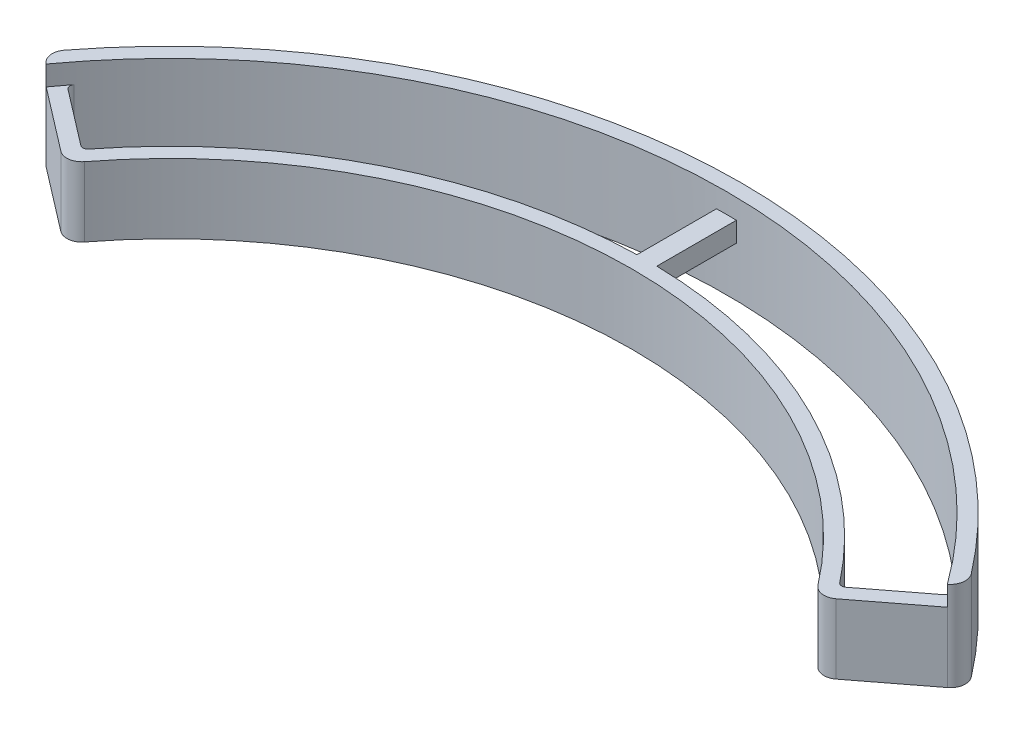
ISO-10303-21;
HEADER;
FILE_DESCRIPTION(('STEP AP214'),'2;1');
FILE_NAME('part.step','',(''),(''),'','','');
FILE_SCHEMA(('AUTOMOTIVE_DESIGN { 1 0 10303 214 1 1 1 1 }'));
ENDSEC;
DATA;
#1=APPLICATION_CONTEXT('core data for automotive mechanical design processes');
#2=APPLICATION_PROTOCOL_DEFINITION('international standard','automotive_design',2000,#1);
#3=PRODUCT_CONTEXT('',#1,'mechanical');
#4=PRODUCT('Part','Part','',(#3));
#5=PRODUCT_RELATED_PRODUCT_CATEGORY('part','',(#4));
#6=PRODUCT_DEFINITION_FORMATION('','',#4);
#7=PRODUCT_DEFINITION_CONTEXT('part definition',#1,'design');
#8=PRODUCT_DEFINITION('design','',#6,#7);
#9=PRODUCT_DEFINITION_SHAPE('','',#8);
#10=(LENGTH_UNIT() NAMED_UNIT(*) SI_UNIT(.MILLI.,.METRE.));
#11=(NAMED_UNIT(*) PLANE_ANGLE_UNIT() SI_UNIT($,.RADIAN.));
#12=(NAMED_UNIT(*) SI_UNIT($,.STERADIAN.) SOLID_ANGLE_UNIT());
#13=UNCERTAINTY_MEASURE_WITH_UNIT(LENGTH_MEASURE(1.E-05),#10,'distance_accuracy_value','');
#14=(GEOMETRIC_REPRESENTATION_CONTEXT(3) GLOBAL_UNCERTAINTY_ASSIGNED_CONTEXT((#13)) GLOBAL_UNIT_ASSIGNED_CONTEXT((#10,
#11,#12)) REPRESENTATION_CONTEXT('',''));
#15=CARTESIAN_POINT('',(0.,0.,0.));
#16=DIRECTION('',(0.,0.,1.));
#17=DIRECTION('',(1.,0.,0.));
#18=AXIS2_PLACEMENT_3D('',#15,#16,#17);
#19=CARTESIAN_POINT('',(0.,0.,0.));
#20=DIRECTION('',(0.,-1.,0.));
#21=DIRECTION('',(0.,0.,-1.));
#22=AXIS2_PLACEMENT_3D('',#19,#20,#21);
#23=PLANE('',#22);
#24=CARTESIAN_POINT('',(0.,0.,0.));
#25=DIRECTION('',(0.,-1.,0.));
#26=DIRECTION('',(0.,0.,-1.));
#27=AXIS2_PLACEMENT_3D('',#24,#25,#26);
#28=CIRCLE('',#27,46.5);
#29=CARTESIAN_POINT('',(-36.8909303235425,0.,-28.3074064489054));
#30=VERTEX_POINT('',#29);
#31=CARTESIAN_POINT('',(36.8909303235425,0.,-28.3074064489054));
#32=VERTEX_POINT('',#31);
#33=EDGE_CURVE('E305',#30,#32,#28,.T.);
#34=ORIENTED_EDGE('',*,*,#33,.T.);
#35=CARTESIAN_POINT('',(38.0809603339793,0.,-29.2205485924185));
#36=DIRECTION('',(0.,-1.,0.));
#37=DIRECTION('',(0.,0.,-1.));
#38=AXIS2_PLACEMENT_3D('',#35,#36,#37);
#39=CIRCLE('',#38,1.5);
#40=CARTESIAN_POINT('',(38.9941024774924,0.,-28.0305185819817));
#41=VERTEX_POINT('',#40);
#42=EDGE_CURVE('E54',#32,#41,#39,.F.);
#43=ORIENTED_EDGE('',*,*,#42,.T.);
#44=DIRECTION('',(0.793353340291236,0.,-0.608761429008719));
#45=VECTOR('',#44,1.);
#46=CARTESIAN_POINT('',(37.7848734387849,0.,-27.1026445059335));
#47=LINE('',#46,#45);
#48=CARTESIAN_POINT('',(45.3249884381113,0.,-32.8883782373816));
#49=VERTEX_POINT('',#48);
#50=EDGE_CURVE('E302',#41,#49,#47,.T.);
#51=ORIENTED_EDGE('',*,*,#50,.T.);
#52=CARTESIAN_POINT('',(0.,0.,0.));
#53=DIRECTION('',(0.,-1.,0.));
#54=DIRECTION('',(0.,0.,-1.));
#55=AXIS2_PLACEMENT_3D('',#52,#53,#54);
#56=CIRCLE('',#55,56.);
#57=CARTESIAN_POINT('',(44.1188612071901,0.,-34.4895068938467));
#58=VERTEX_POINT('',#57);
#59=EDGE_CURVE('E223',#58,#49,#56,.T.);
#60=ORIENTED_EDGE('',*,*,#59,.F.);
#61=CARTESIAN_POINT('',(43.7249428035545,0.,-34.1815648680088));
#62=DIRECTION('',(0.,-1.,0.));
#63=DIRECTION('',(0.,0.,-1.));
#64=AXIS2_PLACEMENT_3D('',#61,#62,#63);
#65=CIRCLE('',#64,0.5);
#66=CARTESIAN_POINT('',(44.0293235180588,0.,-33.7848881978631));
#67=VERTEX_POINT('',#66);
#68=EDGE_CURVE('E297',#58,#67,#65,.T.);
#69=ORIENTED_EDGE('',*,*,#68,.T.);
#70=DIRECTION('',(0.793353340291236,0.,-0.608761429008719));
#71=VECTOR('',#70,1.);
#72=CARTESIAN_POINT('',(38.0809603339793,0.,-29.2205485924185));
#73=LINE('',#72,#71);
#74=CARTESIAN_POINT('',(38.4755922246893,0.,-29.5233602924774));
#75=VERTEX_POINT('',#74);
#76=EDGE_CURVE('E275',#75,#67,#73,.T.);
#77=ORIENTED_EDGE('',*,*,#76,.F.);
#78=CARTESIAN_POINT('',(38.1712115101849,0.,-29.920036962623));
#79=DIRECTION('',(0.,-1.,0.));
#80=DIRECTION('',(0.,0.,-1.));
#81=AXIS2_PLACEMENT_3D('',#78,#79,#80);
#82=CIRCLE('',#81,0.5);
#83=CARTESIAN_POINT('',(37.77769386575,0.,-29.6115829733176));
#84=VERTEX_POINT('',#83);
#85=EDGE_CURVE('E293',#75,#84,#82,.T.);
#86=ORIENTED_EDGE('',*,*,#85,.T.);
#87=CARTESIAN_POINT('',(0.,0.,0.));
#88=DIRECTION('',(0.,-1.,0.));
#89=DIRECTION('',(0.,0.,-1.));
#90=AXIS2_PLACEMENT_3D('',#87,#88,#89);
#91=CIRCLE('',#90,48.);
#92=CARTESIAN_POINT('',(0.999999999999995,0.,-47.9895822028073));
#93=VERTEX_POINT('',#92);
#94=EDGE_CURVE('E261',#93,#84,#91,.T.);
#95=ORIENTED_EDGE('',*,*,#94,.F.);
#96=DIRECTION('',(0.,0.,-1.));
#97=VECTOR('',#96,1.);
#98=CARTESIAN_POINT('',(0.999999999999993,0.,-56.7594807549207));
#99=LINE('',#98,#97);
#100=CARTESIAN_POINT('',(0.999999999999993,0.,-55.9910707166777));
#101=VERTEX_POINT('',#100);
#102=EDGE_CURVE('E202',#93,#101,#99,.T.);
#103=ORIENTED_EDGE('',*,*,#102,.T.);
#104=CARTESIAN_POINT('',(-1.00000000000001,0.,-55.9910707166777));
#105=VERTEX_POINT('',#104);
#106=EDGE_CURVE('E229',#105,#101,#56,.T.);
#107=ORIENTED_EDGE('',*,*,#106,.F.);
#108=DIRECTION('',(0.,0.,1.));
#109=VECTOR('',#108,1.);
#110=CARTESIAN_POINT('',(-1.00000000000001,0.,-56.7594807549207));
#111=LINE('',#110,#109);
#112=CARTESIAN_POINT('',(-1.00000000000001,0.,-47.9895822028073));
#113=VERTEX_POINT('',#112);
#114=EDGE_CURVE('E243',#105,#113,#111,.T.);
#115=ORIENTED_EDGE('',*,*,#114,.T.);
#116=CARTESIAN_POINT('',(-37.77769386575,0.,-29.6115829733176));
#117=VERTEX_POINT('',#116);
#118=EDGE_CURVE('E279',#117,#113,#91,.T.);
#119=ORIENTED_EDGE('',*,*,#118,.F.);
#120=CARTESIAN_POINT('',(-38.1712115101849,0.,-29.920036962623));
#121=DIRECTION('',(0.,-1.,0.));
#122=DIRECTION('',(0.,0.,-1.));
#123=AXIS2_PLACEMENT_3D('',#120,#121,#122);
#124=CIRCLE('',#123,0.5);
#125=CARTESIAN_POINT('',(-38.4755922246893,0.,-29.5233602924774));
#126=VERTEX_POINT('',#125);
#127=EDGE_CURVE('E284',#117,#126,#124,.T.);
#128=ORIENTED_EDGE('',*,*,#127,.T.);
#129=DIRECTION('',(0.793353340291236,0.,0.608761429008719));
#130=VECTOR('',#129,1.);
#131=CARTESIAN_POINT('',(-38.0809603339793,0.,-29.2205485924185));
#132=LINE('',#131,#130);
#133=CARTESIAN_POINT('',(-44.0293235180588,0.,-33.7848881978631));
#134=VERTEX_POINT('',#133);
#135=EDGE_CURVE('E237',#134,#126,#132,.T.);
#136=ORIENTED_EDGE('',*,*,#135,.F.);
#137=CARTESIAN_POINT('',(-43.7249428035545,0.,-34.1815648680088));
#138=DIRECTION('',(0.,-1.,0.));
#139=DIRECTION('',(0.,0.,-1.));
#140=AXIS2_PLACEMENT_3D('',#137,#138,#139);
#141=CIRCLE('',#140,0.5);
#142=CARTESIAN_POINT('',(-44.1188612071901,0.,-34.4895068938467));
#143=VERTEX_POINT('',#142);
#144=EDGE_CURVE('E288',#134,#143,#141,.T.);
#145=ORIENTED_EDGE('',*,*,#144,.T.);
#146=CARTESIAN_POINT('',(-45.3249884381113,0.,-32.8883782373816));
#147=VERTEX_POINT('',#146);
#148=EDGE_CURVE('E215',#147,#143,#56,.T.);
#149=ORIENTED_EDGE('',*,*,#148,.F.);
#150=DIRECTION('',(0.793353340291237,0.,0.608761429008719));
#151=VECTOR('',#150,1.);
#152=CARTESIAN_POINT('',(-37.7848734387849,0.,-27.1026445059335));
#153=LINE('',#152,#151);
#154=CARTESIAN_POINT('',(-38.9941024774924,0.,-28.0305185819817));
#155=VERTEX_POINT('',#154);
#156=EDGE_CURVE('E200',#147,#155,#153,.T.);
#157=ORIENTED_EDGE('',*,*,#156,.T.);
#158=CARTESIAN_POINT('',(-38.0809603339794,0.,-29.2205485924185));
#159=DIRECTION('',(0.,-1.,0.));
#160=DIRECTION('',(0.,0.,-1.));
#161=AXIS2_PLACEMENT_3D('',#158,#159,#160);
#162=CIRCLE('',#161,1.5);
#163=EDGE_CURVE('E47',#155,#30,#162,.F.);
#164=ORIENTED_EDGE('',*,*,#163,.T.);
#165=EDGE_LOOP('',(#34,#43,#51,#60,#69,#77,#86,#95,#103,#107,#115,#119,#128,#136,#145,#149,#157,#164));
#166=FACE_BOUND('',#165,.T.);
#167=ADVANCED_FACE('F32',(#166),#23,.F.);
#168=CARTESIAN_POINT('',(0.,-7.,0.));
#169=DIRECTION('',(0.,1.,0.));
#170=DIRECTION('',(0.,0.,1.));
#171=AXIS2_PLACEMENT_3D('',#168,#169,#170);
#172=CYLINDRICAL_SURFACE('',#171,46.5);
#173=CARTESIAN_POINT('',(0.,-7.,0.));
#174=DIRECTION('',(0.,-1.,0.));
#175=DIRECTION('',(0.,0.,-1.));
#176=AXIS2_PLACEMENT_3D('',#173,#174,#175);
#177=CIRCLE('',#176,46.5);
#178=CARTESIAN_POINT('',(-36.8909303235425,-7.,-28.3074064489054));
#179=VERTEX_POINT('',#178);
#180=CARTESIAN_POINT('',(36.8909303235425,-7.,-28.3074064489054));
#181=VERTEX_POINT('',#180);
#182=EDGE_CURVE('E316',#179,#181,#177,.T.);
#183=ORIENTED_EDGE('',*,*,#182,.T.);
#184=DIRECTION('',(0.,1.,0.));
#185=VECTOR('',#184,1.);
#186=CARTESIAN_POINT('',(36.8909303235425,-7.,-28.3074064489054));
#187=LINE('',#186,#185);
#188=EDGE_CURVE('E451',#181,#32,#187,.T.);
#189=ORIENTED_EDGE('',*,*,#188,.T.);
#190=ORIENTED_EDGE('',*,*,#33,.F.);
#191=DIRECTION('',(0.,1.,0.));
#192=VECTOR('',#191,1.);
#193=CARTESIAN_POINT('',(-36.8909303235425,-7.,-28.3074064489054));
#194=LINE('',#193,#192);
#195=EDGE_CURVE('E437',#30,#179,#194,.F.);
#196=ORIENTED_EDGE('',*,*,#195,.T.);
#197=EDGE_LOOP('',(#183,#189,#190,#196));
#198=FACE_BOUND('',#197,.T.);
#199=ADVANCED_FACE('F385',(#198),#172,.F.);
#200=CARTESIAN_POINT('',(-37.7848734387849,-7.,-27.1026445059335));
#201=DIRECTION('',(-0.608761429008719,0.,0.793353340291237));
#202=DIRECTION('',(0.793353340291237,0.,0.608761429008719));
#203=AXIS2_PLACEMENT_3D('',#200,#201,#202);
#204=PLANE('',#203);
#205=DIRECTION('',(0.793353340291237,0.,0.608761429008719));
#206=VECTOR('',#205,1.);
#207=CARTESIAN_POINT('',(-37.7848734387849,-7.,-27.1026445059335));
#208=LINE('',#207,#206);
#209=CARTESIAN_POINT('',(-45.3409291998223,-7.,-32.9006100140514));
#210=VERTEX_POINT('',#209);
#211=CARTESIAN_POINT('',(-38.9941024774924,-7.,-28.0305185819817));
#212=VERTEX_POINT('',#211);
#213=EDGE_CURVE('E323',#210,#212,#208,.T.);
#214=ORIENTED_EDGE('',*,*,#213,.T.);
#215=DIRECTION('',(0.,1.,0.));
#216=VECTOR('',#215,1.);
#217=CARTESIAN_POINT('',(-38.9941024774924,-7.,-28.0305185819817));
#218=LINE('',#217,#216);
#219=EDGE_CURVE('E11',#212,#155,#218,.T.);
#220=ORIENTED_EDGE('',*,*,#219,.T.);
#221=ORIENTED_EDGE('',*,*,#156,.F.);
#222=DIRECTION('',(0.,-1.,0.));
#223=VECTOR('',#222,1.);
#224=CARTESIAN_POINT('',(-45.3249884381113,2.,-32.8883782373816));
#225=LINE('',#224,#223);
#226=CARTESIAN_POINT('',(-45.3249884381113,2.,-32.8883782373816));
#227=VERTEX_POINT('',#226);
#228=EDGE_CURVE('E196',#227,#147,#225,.T.);
#229=ORIENTED_EDGE('',*,*,#228,.F.);
#230=DIRECTION('',(0.793353340291236,0.,0.60876142900872));
#231=VECTOR('',#230,1.);
#232=CARTESIAN_POINT('',(-45.3249884381113,2.,-32.8883782373816));
#233=LINE('',#232,#231);
#234=CARTESIAN_POINT('',(-45.3409291998223,2.,-32.9006100140514));
#235=VERTEX_POINT('',#234);
#236=EDGE_CURVE('E181',#235,#227,#233,.T.);
#237=ORIENTED_EDGE('',*,*,#236,.F.);
#238=DIRECTION('',(0.,1.,0.));
#239=VECTOR('',#238,1.);
#240=CARTESIAN_POINT('',(-45.3409291998223,-7.,-32.9006100140514));
#241=LINE('',#240,#239);
#242=EDGE_CURVE('E40',#235,#210,#241,.F.);
#243=ORIENTED_EDGE('',*,*,#242,.T.);
#244=EDGE_LOOP('',(#214,#220,#221,#229,#237,#243));
#245=FACE_BOUND('',#244,.T.);
#246=ADVANCED_FACE('F198',(#245),#204,.T.);
#247=CARTESIAN_POINT('',(0.,-7.,0.));
#248=DIRECTION('',(0.,1.,0.));
#249=DIRECTION('',(0.,0.,1.));
#250=AXIS2_PLACEMENT_3D('',#247,#248,#249);
#251=CYLINDRICAL_SURFACE('',#250,57.5);
#252=CARTESIAN_POINT('',(0.,2.,0.));
#253=DIRECTION('',(0.,1.,0.));
#254=DIRECTION('',(0.,0.,-1.));
#255=AXIS2_PLACEMENT_3D('',#252,#253,#254);
#256=CIRCLE('',#255,57.5);
#257=CARTESIAN_POINT('',(45.6178170667461,2.,-35.0037821680013));
#258=VERTEX_POINT('',#257);
#259=CARTESIAN_POINT('',(-45.6178170667461,2.,-35.0037821680014));
#260=VERTEX_POINT('',#259);
#261=EDGE_CURVE('E192',#258,#260,#256,.T.);
#262=ORIENTED_EDGE('',*,*,#261,.F.);
#263=DIRECTION('',(0.,1.,0.));
#264=VECTOR('',#263,1.);
#265=CARTESIAN_POINT('',(45.6178170667461,-7.,-35.0037821680014));
#266=LINE('',#265,#264);
#267=CARTESIAN_POINT('',(45.6178170667461,-7.,-35.0037821680013));
#268=VERTEX_POINT('',#267);
#269=EDGE_CURVE('E445',#258,#268,#266,.F.);
#270=ORIENTED_EDGE('',*,*,#269,.T.);
#271=CARTESIAN_POINT('',(0.,-7.,0.));
#272=DIRECTION('',(0.,1.,0.));
#273=DIRECTION('',(0.,0.,-1.));
#274=AXIS2_PLACEMENT_3D('',#271,#272,#273);
#275=CIRCLE('',#274,57.5);
#276=CARTESIAN_POINT('',(-45.6178170667461,-7.,-35.0037821680014));
#277=VERTEX_POINT('',#276);
#278=EDGE_CURVE('E328',#268,#277,#275,.T.);
#279=ORIENTED_EDGE('',*,*,#278,.T.);
#280=DIRECTION('',(0.,1.,0.));
#281=VECTOR('',#280,1.);
#282=CARTESIAN_POINT('',(-45.6178170667461,-7.,-35.0037821680014));
#283=LINE('',#282,#281);
#284=EDGE_CURVE('E458',#277,#260,#283,.T.);
#285=ORIENTED_EDGE('',*,*,#284,.T.);
#286=EDGE_LOOP('',(#262,#270,#279,#285));
#287=FACE_BOUND('',#286,.T.);
#288=ADVANCED_FACE('F399',(#287),#251,.T.);
#289=CARTESIAN_POINT('',(37.7848734387849,-7.,-27.1026445059335));
#290=DIRECTION('',(0.608761429008719,0.,0.793353340291236));
#291=DIRECTION('',(0.793353340291236,0.,-0.608761429008719));
#292=AXIS2_PLACEMENT_3D('',#289,#290,#291);
#293=PLANE('',#292);
#294=DIRECTION('',(0.793353340291236,0.,-0.608761429008719));
#295=VECTOR('',#294,1.);
#296=CARTESIAN_POINT('',(37.7848734387849,-7.,-27.1026445059335));
#297=LINE('',#296,#295);
#298=CARTESIAN_POINT('',(38.9941024774924,-7.,-28.0305185819817));
#299=VERTEX_POINT('',#298);
#300=CARTESIAN_POINT('',(45.3409291998223,-7.,-32.9006100140514));
#301=VERTEX_POINT('',#300);
#302=EDGE_CURVE('E331',#299,#301,#297,.T.);
#303=ORIENTED_EDGE('',*,*,#302,.T.);
#304=DIRECTION('',(0.,1.,0.));
#305=VECTOR('',#304,1.);
#306=CARTESIAN_POINT('',(45.3409291998223,-7.,-32.9006100140514));
#307=LINE('',#306,#305);
#308=CARTESIAN_POINT('',(45.3409291998223,2.,-32.9006100140514));
#309=VERTEX_POINT('',#308);
#310=EDGE_CURVE('E464',#301,#309,#307,.T.);
#311=ORIENTED_EDGE('',*,*,#310,.T.);
#312=DIRECTION('',(0.793353340291236,0.,-0.608761429008719));
#313=VECTOR('',#312,1.);
#314=CARTESIAN_POINT('',(45.3249884381113,2.,-32.8883782373816));
#315=LINE('',#314,#313);
#316=CARTESIAN_POINT('',(45.3249884381113,2.,-32.8883782373816));
#317=VERTEX_POINT('',#316);
#318=EDGE_CURVE('E210',#317,#309,#315,.T.);
#319=ORIENTED_EDGE('',*,*,#318,.F.);
#320=DIRECTION('',(0.,-1.,0.));
#321=VECTOR('',#320,1.);
#322=CARTESIAN_POINT('',(45.3249884381113,2.,-32.8883782373816));
#323=LINE('',#322,#321);
#324=EDGE_CURVE('E203',#317,#49,#323,.T.);
#325=ORIENTED_EDGE('',*,*,#324,.T.);
#326=ORIENTED_EDGE('',*,*,#50,.F.);
#327=DIRECTION('',(0.,1.,0.));
#328=VECTOR('',#327,1.);
#329=CARTESIAN_POINT('',(38.9941024774924,-7.,-28.0305185819817));
#330=LINE('',#329,#328);
#331=EDGE_CURVE('E301',#41,#299,#330,.F.);
#332=ORIENTED_EDGE('',*,*,#331,.T.);
#333=EDGE_LOOP('',(#303,#311,#319,#325,#326,#332));
#334=FACE_BOUND('',#333,.T.);
#335=ADVANCED_FACE('F402',(#334),#293,.T.);
#336=CARTESIAN_POINT('',(0.,-7.,0.));
#337=DIRECTION('',(0.,-1.,0.));
#338=DIRECTION('',(0.,0.,-1.));
#339=AXIS2_PLACEMENT_3D('',#336,#337,#338);
#340=PLANE('',#339);
#341=DIRECTION('',(0.793353340291236,0.,-0.608761429008719));
#342=VECTOR('',#341,1.);
#343=CARTESIAN_POINT('',(38.0809603339793,-7.,-29.2205485924185));
#344=LINE('',#343,#342);
#345=CARTESIAN_POINT('',(38.4755922246893,-7.,-29.5233602924774));
#346=VERTEX_POINT('',#345);
#347=CARTESIAN_POINT('',(44.0293235180588,-7.,-33.7848881978631));
#348=VERTEX_POINT('',#347);
#349=EDGE_CURVE('E339',#346,#348,#344,.T.);
#350=ORIENTED_EDGE('',*,*,#349,.T.);
#351=CARTESIAN_POINT('',(43.7249428035545,-7.,-34.1815648680088));
#352=DIRECTION('',(0.,-1.,0.));
#353=DIRECTION('',(0.,0.,-1.));
#354=AXIS2_PLACEMENT_3D('',#351,#352,#353);
#355=CIRCLE('',#354,0.5);
#356=CARTESIAN_POINT('',(44.1188612071901,-7.,-34.4895068938467));
#357=VERTEX_POINT('',#356);
#358=EDGE_CURVE('E299',#348,#357,#355,.F.);
#359=ORIENTED_EDGE('',*,*,#358,.T.);
#360=CARTESIAN_POINT('',(0.,-7.,0.));
#361=DIRECTION('',(0.,1.,0.));
#362=DIRECTION('',(0.,0.,-1.));
#363=AXIS2_PLACEMENT_3D('',#360,#361,#362);
#364=CIRCLE('',#363,56.);
#365=CARTESIAN_POINT('',(-44.1188612071901,-7.,-34.4895068938467));
#366=VERTEX_POINT('',#365);
#367=EDGE_CURVE('E278',#357,#366,#364,.T.);
#368=ORIENTED_EDGE('',*,*,#367,.T.);
#369=CARTESIAN_POINT('',(-43.7249428035545,-7.,-34.1815648680088));
#370=DIRECTION('',(0.,-1.,0.));
#371=DIRECTION('',(0.,0.,-1.));
#372=AXIS2_PLACEMENT_3D('',#369,#370,#371);
#373=CIRCLE('',#372,0.5);
#374=CARTESIAN_POINT('',(-44.0293235180588,-7.,-33.7848881978631));
#375=VERTEX_POINT('',#374);
#376=EDGE_CURVE('E291',#366,#375,#373,.F.);
#377=ORIENTED_EDGE('',*,*,#376,.T.);
#378=DIRECTION('',(0.793353340291236,0.,0.608761429008719));
#379=VECTOR('',#378,1.);
#380=CARTESIAN_POINT('',(-38.0809603339793,-7.,-29.2205485924185));
#381=LINE('',#380,#379);
#382=CARTESIAN_POINT('',(-38.4755922246893,-7.,-29.5233602924774));
#383=VERTEX_POINT('',#382);
#384=EDGE_CURVE('E345',#375,#383,#381,.T.);
#385=ORIENTED_EDGE('',*,*,#384,.T.);
#386=CARTESIAN_POINT('',(-38.1712115101849,-7.,-29.920036962623));
#387=DIRECTION('',(0.,-1.,0.));
#388=DIRECTION('',(0.,0.,-1.));
#389=AXIS2_PLACEMENT_3D('',#386,#387,#388);
#390=CIRCLE('',#389,0.5);
#391=CARTESIAN_POINT('',(-37.77769386575,-7.,-29.6115829733176));
#392=VERTEX_POINT('',#391);
#393=EDGE_CURVE('E286',#383,#392,#390,.F.);
#394=ORIENTED_EDGE('',*,*,#393,.T.);
#395=CARTESIAN_POINT('',(0.,-7.,0.));
#396=DIRECTION('',(0.,-1.,0.));
#397=DIRECTION('',(0.,0.,-1.));
#398=AXIS2_PLACEMENT_3D('',#395,#396,#397);
#399=CIRCLE('',#398,48.);
#400=CARTESIAN_POINT('',(37.77769386575,-7.,-29.6115829733176));
#401=VERTEX_POINT('',#400);
#402=EDGE_CURVE('E342',#392,#401,#399,.T.);
#403=ORIENTED_EDGE('',*,*,#402,.T.);
#404=CARTESIAN_POINT('',(38.1712115101849,-7.,-29.920036962623));
#405=DIRECTION('',(0.,-1.,0.));
#406=DIRECTION('',(0.,0.,-1.));
#407=AXIS2_PLACEMENT_3D('',#404,#405,#406);
#408=CIRCLE('',#407,0.5);
#409=EDGE_CURVE('E295',#401,#346,#408,.F.);
#410=ORIENTED_EDGE('',*,*,#409,.T.);
#411=EDGE_LOOP('',(#350,#359,#368,#377,#385,#394,#403,#410));
#412=FACE_BOUND('',#411,.T.);
#413=ORIENTED_EDGE('',*,*,#278,.F.);
#414=CARTESIAN_POINT('',(44.4277870563092,-7.,-34.0906400244883));
#415=DIRECTION('',(0.,-1.,0.));
#416=DIRECTION('',(0.,0.,-1.));
#417=AXIS2_PLACEMENT_3D('',#414,#415,#416);
#418=CIRCLE('',#417,1.5);
#419=EDGE_CURVE('E443',#268,#301,#418,.T.);
#420=ORIENTED_EDGE('',*,*,#419,.T.);
#421=ORIENTED_EDGE('',*,*,#302,.F.);
#422=CARTESIAN_POINT('',(38.0809603339793,-7.,-29.2205485924185));
#423=DIRECTION('',(0.,-1.,0.));
#424=DIRECTION('',(0.,0.,-1.));
#425=AXIS2_PLACEMENT_3D('',#422,#423,#424);
#426=CIRCLE('',#425,1.5);
#427=EDGE_CURVE('E440',#299,#181,#426,.T.);
#428=ORIENTED_EDGE('',*,*,#427,.T.);
#429=ORIENTED_EDGE('',*,*,#182,.F.);
#430=CARTESIAN_POINT('',(-38.0809603339794,-7.,-29.2205485924185));
#431=DIRECTION('',(0.,-1.,0.));
#432=DIRECTION('',(0.,0.,-1.));
#433=AXIS2_PLACEMENT_3D('',#430,#431,#432);
#434=CIRCLE('',#433,1.5);
#435=EDGE_CURVE('E436',#179,#212,#434,.T.);
#436=ORIENTED_EDGE('',*,*,#435,.T.);
#437=ORIENTED_EDGE('',*,*,#213,.F.);
#438=CARTESIAN_POINT('',(-44.4277870563092,-7.,-34.0906400244883));
#439=DIRECTION('',(0.,-1.,0.));
#440=DIRECTION('',(0.,0.,-1.));
#441=AXIS2_PLACEMENT_3D('',#438,#439,#440);
#442=CIRCLE('',#441,1.5);
#443=EDGE_CURVE('E441',#210,#277,#442,.T.);
#444=ORIENTED_EDGE('',*,*,#443,.T.);
#445=EDGE_LOOP('',(#413,#420,#421,#428,#429,#436,#437,#444));
#446=FACE_BOUND('',#445,.T.);
#447=ADVANCED_FACE('F395',(#412,#446),#340,.T.);
#448=CARTESIAN_POINT('',(0.,-7.,0.));
#449=DIRECTION('',(0.,1.,0.));
#450=DIRECTION('',(0.,0.,1.));
#451=AXIS2_PLACEMENT_3D('',#448,#449,#450);
#452=CYLINDRICAL_SURFACE('',#451,56.);
#453=ORIENTED_EDGE('',*,*,#148,.T.);
#454=DIRECTION('',(0.,1.,0.));
#455=VECTOR('',#454,1.);
#456=CARTESIAN_POINT('',(-44.1188612071901,-7.,-34.4895068938467));
#457=LINE('',#456,#455);
#458=EDGE_CURVE('E272',#143,#366,#457,.F.);
#459=ORIENTED_EDGE('',*,*,#458,.T.);
#460=ORIENTED_EDGE('',*,*,#367,.F.);
#461=DIRECTION('',(0.,1.,0.));
#462=VECTOR('',#461,1.);
#463=CARTESIAN_POINT('',(44.1188612071901,-7.,-34.4895068938467));
#464=LINE('',#463,#462);
#465=EDGE_CURVE('E269',#357,#58,#464,.T.);
#466=ORIENTED_EDGE('',*,*,#465,.T.);
#467=ORIENTED_EDGE('',*,*,#59,.T.);
#468=ORIENTED_EDGE('',*,*,#324,.F.);
#469=CARTESIAN_POINT('',(0.,2.,0.));
#470=DIRECTION('',(0.,-1.,0.));
#471=DIRECTION('',(0.,0.,-1.));
#472=AXIS2_PLACEMENT_3D('',#469,#470,#471);
#473=CIRCLE('',#472,56.);
#474=EDGE_CURVE('E186',#227,#317,#473,.T.);
#475=ORIENTED_EDGE('',*,*,#474,.F.);
#476=ORIENTED_EDGE('',*,*,#228,.T.);
#477=EDGE_LOOP('',(#453,#459,#460,#466,#467,#468,#475,#476));
#478=FACE_BOUND('',#477,.T.);
#479=DIRECTION('',(0.,1.,0.));
#480=VECTOR('',#479,1.);
#481=CARTESIAN_POINT('',(-1.00000000000001,-7.,-55.9910707166777));
#482=LINE('',#481,#480);
#483=CARTESIAN_POINT('',(-1.00000000000001,-2.,-55.9910707166777));
#484=VERTEX_POINT('',#483);
#485=EDGE_CURVE('E238',#484,#105,#482,.T.);
#486=ORIENTED_EDGE('',*,*,#485,.T.);
#487=ORIENTED_EDGE('',*,*,#106,.T.);
#488=DIRECTION('',(0.,1.,0.));
#489=VECTOR('',#488,1.);
#490=CARTESIAN_POINT('',(0.999999999999993,-7.,-55.9910707166777));
#491=LINE('',#490,#489);
#492=CARTESIAN_POINT('',(0.999999999999993,-2.,-55.9910707166777));
#493=VERTEX_POINT('',#492);
#494=EDGE_CURVE('E235',#101,#493,#491,.F.);
#495=ORIENTED_EDGE('',*,*,#494,.T.);
#496=CARTESIAN_POINT('',(0.,-2.,0.));
#497=DIRECTION('',(0.,1.,0.));
#498=DIRECTION('',(0.,0.,1.));
#499=AXIS2_PLACEMENT_3D('',#496,#497,#498);
#500=CIRCLE('',#499,56.);
#501=EDGE_CURVE('E248',#484,#493,#500,.F.);
#502=ORIENTED_EDGE('',*,*,#501,.F.);
#503=EDGE_LOOP('',(#486,#487,#495,#502));
#504=FACE_BOUND('',#503,.T.);
#505=ADVANCED_FACE('F205',(#478,#504),#452,.F.);
#506=CARTESIAN_POINT('',(38.0809603339793,-7.,-29.2205485924185));
#507=DIRECTION('',(0.608761429008719,0.,0.793353340291236));
#508=DIRECTION('',(0.793353340291236,0.,-0.608761429008719));
#509=AXIS2_PLACEMENT_3D('',#506,#507,#508);
#510=PLANE('',#509);
#511=ORIENTED_EDGE('',*,*,#349,.F.);
#512=DIRECTION('',(0.,-1.,0.));
#513=VECTOR('',#512,1.);
#514=CARTESIAN_POINT('',(38.4755922246893,0.,-29.5233602924774));
#515=LINE('',#514,#513);
#516=EDGE_CURVE('E281',#346,#75,#515,.F.);
#517=ORIENTED_EDGE('',*,*,#516,.T.);
#518=ORIENTED_EDGE('',*,*,#76,.T.);
#519=DIRECTION('',(0.,-1.,0.));
#520=VECTOR('',#519,1.);
#521=CARTESIAN_POINT('',(44.0293235180588,-7.,-33.7848881978631));
#522=LINE('',#521,#520);
#523=EDGE_CURVE('E274',#67,#348,#522,.T.);
#524=ORIENTED_EDGE('',*,*,#523,.T.);
#525=EDGE_LOOP('',(#511,#517,#518,#524));
#526=FACE_BOUND('',#525,.T.);
#527=ADVANCED_FACE('F374',(#526),#510,.F.);
#528=CARTESIAN_POINT('',(0.,-7.,0.));
#529=DIRECTION('',(0.,1.,0.));
#530=DIRECTION('',(0.,0.,1.));
#531=AXIS2_PLACEMENT_3D('',#528,#529,#530);
#532=CYLINDRICAL_SURFACE('',#531,48.);
#533=ORIENTED_EDGE('',*,*,#402,.F.);
#534=DIRECTION('',(0.,1.,0.));
#535=VECTOR('',#534,1.);
#536=CARTESIAN_POINT('',(-37.77769386575,-7.,-29.6115829733176));
#537=LINE('',#536,#535);
#538=EDGE_CURVE('E262',#392,#117,#537,.T.);
#539=ORIENTED_EDGE('',*,*,#538,.T.);
#540=ORIENTED_EDGE('',*,*,#118,.T.);
#541=DIRECTION('',(0.,1.,0.));
#542=VECTOR('',#541,1.);
#543=CARTESIAN_POINT('',(-1.00000000000001,-7.,-47.9895822028073));
#544=LINE('',#543,#542);
#545=CARTESIAN_POINT('',(-1.00000000000001,-2.,-47.9895822028073));
#546=VERTEX_POINT('',#545);
#547=EDGE_CURVE('E319',#113,#546,#544,.F.);
#548=ORIENTED_EDGE('',*,*,#547,.T.);
#549=CARTESIAN_POINT('',(0.,-2.,0.));
#550=DIRECTION('',(0.,1.,0.));
#551=DIRECTION('',(0.,0.,1.));
#552=AXIS2_PLACEMENT_3D('',#549,#550,#551);
#553=CIRCLE('',#552,48.);
#554=CARTESIAN_POINT('',(0.999999999999995,-2.,-47.9895822028073));
#555=VERTEX_POINT('',#554);
#556=EDGE_CURVE('E313',#555,#546,#553,.T.);
#557=ORIENTED_EDGE('',*,*,#556,.F.);
#558=DIRECTION('',(0.,1.,0.));
#559=VECTOR('',#558,1.);
#560=CARTESIAN_POINT('',(0.999999999999995,-7.,-47.9895822028073));
#561=LINE('',#560,#559);
#562=EDGE_CURVE('E317',#555,#93,#561,.T.);
#563=ORIENTED_EDGE('',*,*,#562,.T.);
#564=ORIENTED_EDGE('',*,*,#94,.T.);
#565=DIRECTION('',(0.,1.,0.));
#566=VECTOR('',#565,1.);
#567=CARTESIAN_POINT('',(37.77769386575,-7.,-29.6115829733176));
#568=LINE('',#567,#566);
#569=EDGE_CURVE('E233',#84,#401,#568,.F.);
#570=ORIENTED_EDGE('',*,*,#569,.T.);
#571=EDGE_LOOP('',(#533,#539,#540,#548,#557,#563,#564,#570));
#572=FACE_BOUND('',#571,.T.);
#573=ADVANCED_FACE('F369',(#572),#532,.T.);
#574=CARTESIAN_POINT('',(-38.0809603339793,-7.,-29.2205485924185));
#575=DIRECTION('',(-0.608761429008719,0.,0.793353340291236));
#576=DIRECTION('',(0.793353340291236,0.,0.608761429008719));
#577=AXIS2_PLACEMENT_3D('',#574,#575,#576);
#578=PLANE('',#577);
#579=ORIENTED_EDGE('',*,*,#135,.T.);
#580=DIRECTION('',(0.,-1.,0.));
#581=VECTOR('',#580,1.);
#582=CARTESIAN_POINT('',(-38.4755922246893,-7.,-29.5233602924774));
#583=LINE('',#582,#581);
#584=EDGE_CURVE('E267',#126,#383,#583,.T.);
#585=ORIENTED_EDGE('',*,*,#584,.T.);
#586=ORIENTED_EDGE('',*,*,#384,.F.);
#587=DIRECTION('',(0.,-1.,0.));
#588=VECTOR('',#587,1.);
#589=CARTESIAN_POINT('',(-44.0293235180588,0.,-33.7848881978631));
#590=LINE('',#589,#588);
#591=EDGE_CURVE('E264',#375,#134,#590,.F.);
#592=ORIENTED_EDGE('',*,*,#591,.T.);
#593=EDGE_LOOP('',(#579,#585,#586,#592));
#594=FACE_BOUND('',#593,.T.);
#595=ADVANCED_FACE('F373',(#594),#578,.F.);
#596=CARTESIAN_POINT('',(0.999999999999993,-2.,-56.7594807549207));
#597=DIRECTION('',(1.,0.,0.));
#598=DIRECTION('',(0.,0.,-1.));
#599=AXIS2_PLACEMENT_3D('',#596,#597,#598);
#600=PLANE('',#599);
#601=ORIENTED_EDGE('',*,*,#494,.F.);
#602=ORIENTED_EDGE('',*,*,#102,.F.);
#603=ORIENTED_EDGE('',*,*,#562,.F.);
#604=DIRECTION('',(0.,0.,-1.));
#605=VECTOR('',#604,1.);
#606=CARTESIAN_POINT('',(0.999999999999993,-2.,-56.7594807549207));
#607=LINE('',#606,#605);
#608=EDGE_CURVE('E218',#555,#493,#607,.T.);
#609=ORIENTED_EDGE('',*,*,#608,.T.);
#610=EDGE_LOOP('',(#601,#602,#603,#609));
#611=FACE_BOUND('',#610,.T.);
#612=ADVANCED_FACE('F357',(#611),#600,.T.);
#613=CARTESIAN_POINT('',(-1.00000000000001,-2.,-56.7594807549207));
#614=DIRECTION('',(-1.,0.,0.));
#615=DIRECTION('',(0.,0.,1.));
#616=AXIS2_PLACEMENT_3D('',#613,#614,#615);
#617=PLANE('',#616);
#618=ORIENTED_EDGE('',*,*,#485,.F.);
#619=DIRECTION('',(0.,0.,1.));
#620=VECTOR('',#619,1.);
#621=CARTESIAN_POINT('',(-1.00000000000001,-2.,-56.7594807549207));
#622=LINE('',#621,#620);
#623=EDGE_CURVE('E351',#484,#546,#622,.T.);
#624=ORIENTED_EDGE('',*,*,#623,.T.);
#625=ORIENTED_EDGE('',*,*,#547,.F.);
#626=ORIENTED_EDGE('',*,*,#114,.F.);
#627=EDGE_LOOP('',(#618,#624,#625,#626));
#628=FACE_BOUND('',#627,.T.);
#629=ADVANCED_FACE('F361',(#628),#617,.T.);
#630=CARTESIAN_POINT('',(0.,-2.,0.));
#631=DIRECTION('',(0.,1.,0.));
#632=DIRECTION('',(0.,0.,1.));
#633=AXIS2_PLACEMENT_3D('',#630,#631,#632);
#634=PLANE('',#633);
#635=ORIENTED_EDGE('',*,*,#623,.F.);
#636=ORIENTED_EDGE('',*,*,#501,.T.);
#637=ORIENTED_EDGE('',*,*,#608,.F.);
#638=ORIENTED_EDGE('',*,*,#556,.T.);
#639=EDGE_LOOP('',(#635,#636,#637,#638));
#640=FACE_BOUND('',#639,.T.);
#641=ADVANCED_FACE('F359',(#640),#634,.F.);
#642=CARTESIAN_POINT('',(0.,2.,0.));
#643=DIRECTION('',(0.,-1.,0.));
#644=DIRECTION('',(0.,0.,-1.));
#645=AXIS2_PLACEMENT_3D('',#642,#643,#644);
#646=PLANE('',#645);
#647=ORIENTED_EDGE('',*,*,#318,.T.);
#648=CARTESIAN_POINT('',(44.4277870563092,2.,-34.0906400244883));
#649=DIRECTION('',(0.,-1.,0.));
#650=DIRECTION('',(0.,0.,-1.));
#651=AXIS2_PLACEMENT_3D('',#648,#649,#650);
#652=CIRCLE('',#651,1.5);
#653=EDGE_CURVE('E460',#309,#258,#652,.F.);
#654=ORIENTED_EDGE('',*,*,#653,.T.);
#655=ORIENTED_EDGE('',*,*,#261,.T.);
#656=CARTESIAN_POINT('',(-44.4277870563092,2.,-34.0906400244883));
#657=DIRECTION('',(0.,-1.,0.));
#658=DIRECTION('',(0.,0.,-1.));
#659=AXIS2_PLACEMENT_3D('',#656,#657,#658);
#660=CIRCLE('',#659,1.5);
#661=EDGE_CURVE('E189',#260,#235,#660,.F.);
#662=ORIENTED_EDGE('',*,*,#661,.T.);
#663=ORIENTED_EDGE('',*,*,#236,.T.);
#664=ORIENTED_EDGE('',*,*,#474,.T.);
#665=EDGE_LOOP('',(#647,#654,#655,#662,#663,#664));
#666=FACE_BOUND('',#665,.T.);
#667=ADVANCED_FACE('F184',(#666),#646,.F.);
#668=CARTESIAN_POINT('',(-38.1712115101849,-7.,-29.920036962623));
#669=DIRECTION('',(0.,1.,0.));
#670=DIRECTION('',(0.,0.,1.));
#671=AXIS2_PLACEMENT_3D('',#668,#669,#670);
#672=CYLINDRICAL_SURFACE('',#671,0.5);
#673=ORIENTED_EDGE('',*,*,#393,.F.);
#674=ORIENTED_EDGE('',*,*,#584,.F.);
#675=ORIENTED_EDGE('',*,*,#127,.F.);
#676=ORIENTED_EDGE('',*,*,#538,.F.);
#677=EDGE_LOOP('',(#673,#674,#675,#676));
#678=FACE_BOUND('',#677,.T.);
#679=ADVANCED_FACE('F407',(#678),#672,.F.);
#680=CARTESIAN_POINT('',(-43.7249428035545,-7.,-34.1815648680088));
#681=DIRECTION('',(0.,1.,0.));
#682=DIRECTION('',(0.,0.,1.));
#683=AXIS2_PLACEMENT_3D('',#680,#681,#682);
#684=CYLINDRICAL_SURFACE('',#683,0.5);
#685=ORIENTED_EDGE('',*,*,#376,.F.);
#686=ORIENTED_EDGE('',*,*,#458,.F.);
#687=ORIENTED_EDGE('',*,*,#144,.F.);
#688=ORIENTED_EDGE('',*,*,#591,.F.);
#689=EDGE_LOOP('',(#685,#686,#687,#688));
#690=FACE_BOUND('',#689,.T.);
#691=ADVANCED_FACE('F410',(#690),#684,.F.);
#692=CARTESIAN_POINT('',(38.1712115101849,-7.,-29.920036962623));
#693=DIRECTION('',(0.,1.,0.));
#694=DIRECTION('',(0.,0.,1.));
#695=AXIS2_PLACEMENT_3D('',#692,#693,#694);
#696=CYLINDRICAL_SURFACE('',#695,0.5);
#697=ORIENTED_EDGE('',*,*,#409,.F.);
#698=ORIENTED_EDGE('',*,*,#569,.F.);
#699=ORIENTED_EDGE('',*,*,#85,.F.);
#700=ORIENTED_EDGE('',*,*,#516,.F.);
#701=EDGE_LOOP('',(#697,#698,#699,#700));
#702=FACE_BOUND('',#701,.T.);
#703=ADVANCED_FACE('F414',(#702),#696,.F.);
#704=CARTESIAN_POINT('',(43.7249428035545,-7.,-34.1815648680088));
#705=DIRECTION('',(0.,1.,0.));
#706=DIRECTION('',(0.,0.,1.));
#707=AXIS2_PLACEMENT_3D('',#704,#705,#706);
#708=CYLINDRICAL_SURFACE('',#707,0.5);
#709=ORIENTED_EDGE('',*,*,#358,.F.);
#710=ORIENTED_EDGE('',*,*,#523,.F.);
#711=ORIENTED_EDGE('',*,*,#68,.F.);
#712=ORIENTED_EDGE('',*,*,#465,.F.);
#713=EDGE_LOOP('',(#709,#710,#711,#712));
#714=FACE_BOUND('',#713,.T.);
#715=ADVANCED_FACE('F418',(#714),#708,.F.);
#716=CARTESIAN_POINT('',(44.4277870563092,-7.,-34.0906400244883));
#717=DIRECTION('',(0.,1.,0.));
#718=DIRECTION('',(0.,0.,1.));
#719=AXIS2_PLACEMENT_3D('',#716,#717,#718);
#720=CYLINDRICAL_SURFACE('',#719,1.5);
#721=ORIENTED_EDGE('',*,*,#419,.F.);
#722=ORIENTED_EDGE('',*,*,#269,.F.);
#723=ORIENTED_EDGE('',*,*,#653,.F.);
#724=ORIENTED_EDGE('',*,*,#310,.F.);
#725=EDGE_LOOP('',(#721,#722,#723,#724));
#726=FACE_BOUND('',#725,.T.);
#727=ADVANCED_FACE('F422',(#726),#720,.T.);
#728=CARTESIAN_POINT('',(38.0809603339793,-7.,-29.2205485924185));
#729=DIRECTION('',(0.,1.,0.));
#730=DIRECTION('',(0.,0.,1.));
#731=AXIS2_PLACEMENT_3D('',#728,#729,#730);
#732=CYLINDRICAL_SURFACE('',#731,1.5);
#733=ORIENTED_EDGE('',*,*,#427,.F.);
#734=ORIENTED_EDGE('',*,*,#331,.F.);
#735=ORIENTED_EDGE('',*,*,#42,.F.);
#736=ORIENTED_EDGE('',*,*,#188,.F.);
#737=EDGE_LOOP('',(#733,#734,#735,#736));
#738=FACE_BOUND('',#737,.T.);
#739=ADVANCED_FACE('F426',(#738),#732,.T.);
#740=CARTESIAN_POINT('',(-38.0809603339794,-7.,-29.2205485924185));
#741=DIRECTION('',(0.,1.,0.));
#742=DIRECTION('',(0.,0.,1.));
#743=AXIS2_PLACEMENT_3D('',#740,#741,#742);
#744=CYLINDRICAL_SURFACE('',#743,1.5);
#745=ORIENTED_EDGE('',*,*,#435,.F.);
#746=ORIENTED_EDGE('',*,*,#195,.F.);
#747=ORIENTED_EDGE('',*,*,#163,.F.);
#748=ORIENTED_EDGE('',*,*,#219,.F.);
#749=EDGE_LOOP('',(#745,#746,#747,#748));
#750=FACE_BOUND('',#749,.T.);
#751=ADVANCED_FACE('F429',(#750),#744,.T.);
#752=CARTESIAN_POINT('',(-44.4277870563092,-7.,-34.0906400244883));
#753=DIRECTION('',(0.,1.,0.));
#754=DIRECTION('',(0.,0.,1.));
#755=AXIS2_PLACEMENT_3D('',#752,#753,#754);
#756=CYLINDRICAL_SURFACE('',#755,1.5);
#757=ORIENTED_EDGE('',*,*,#443,.F.);
#758=ORIENTED_EDGE('',*,*,#242,.F.);
#759=ORIENTED_EDGE('',*,*,#661,.F.);
#760=ORIENTED_EDGE('',*,*,#284,.F.);
#761=EDGE_LOOP('',(#757,#758,#759,#760));
#762=FACE_BOUND('',#761,.T.);
#763=ADVANCED_FACE('F34',(#762),#756,.T.);
#764=CLOSED_SHELL('',(#167,#199,#246,#288,#335,#447,#505,#527,#573,#595,#612,#629,#641,#667,
#679,#691,#703,#715,#727,#739,#751,#763));
#765=MANIFOLD_SOLID_BREP('B2',#764);
#766=ADVANCED_BREP_SHAPE_REPRESENTATION('',(#18,#765),#14);
#767=SHAPE_DEFINITION_REPRESENTATION(#9,#766);
ENDSEC;
END-ISO-10303-21;
